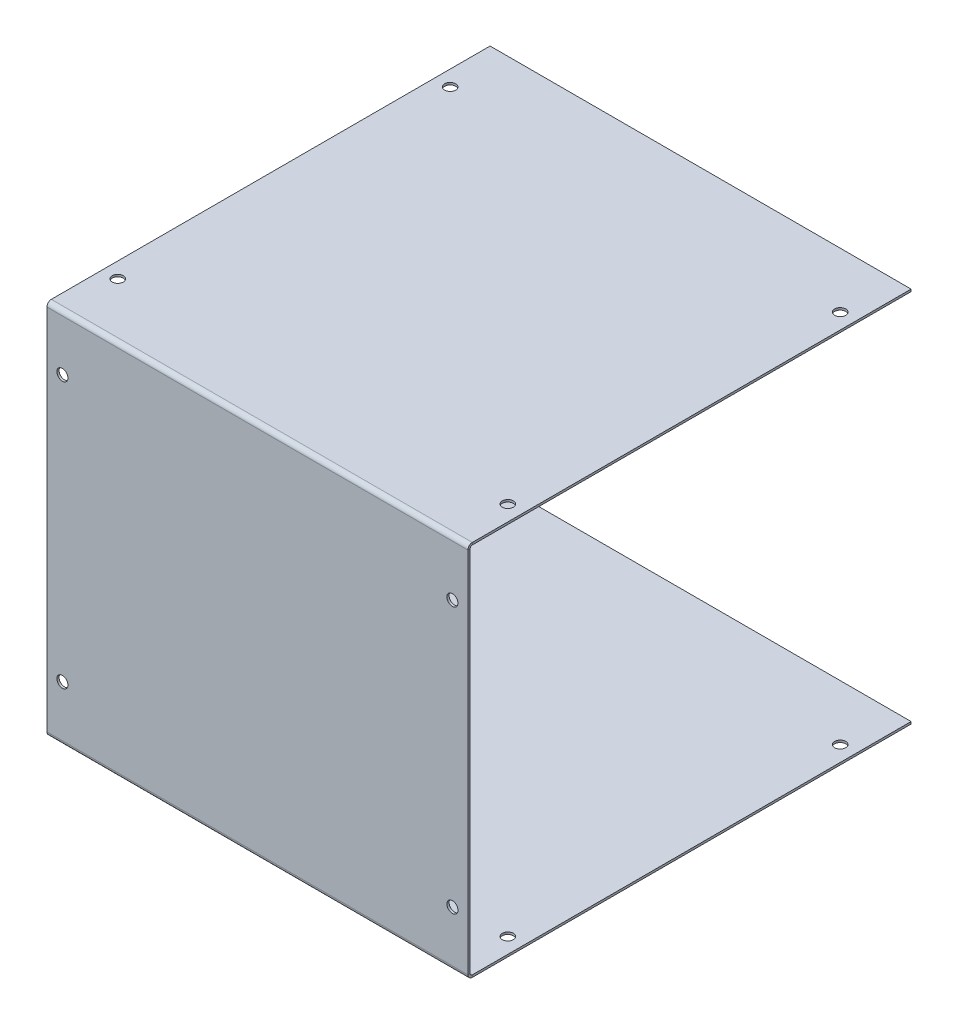
ISO-10303-21;
HEADER;
FILE_DESCRIPTION(('STEP AP214'),'2;1');
FILE_NAME('part.step','',(''),(''),'','','');
FILE_SCHEMA(('AUTOMOTIVE_DESIGN { 1 0 10303 214 1 1 1 1 }'));
ENDSEC;
DATA;
#1=APPLICATION_CONTEXT('core data for automotive mechanical design processes');
#2=APPLICATION_PROTOCOL_DEFINITION('international standard','automotive_design',2000,#1);
#3=PRODUCT_CONTEXT('',#1,'mechanical');
#4=PRODUCT('Part','Part','',(#3));
#5=PRODUCT_RELATED_PRODUCT_CATEGORY('part','',(#4));
#6=PRODUCT_DEFINITION_FORMATION('','',#4);
#7=PRODUCT_DEFINITION_CONTEXT('part definition',#1,'design');
#8=PRODUCT_DEFINITION('design','',#6,#7);
#9=PRODUCT_DEFINITION_SHAPE('','',#8);
#10=(LENGTH_UNIT() NAMED_UNIT(*) SI_UNIT(.MILLI.,.METRE.));
#11=(NAMED_UNIT(*) PLANE_ANGLE_UNIT() SI_UNIT($,.RADIAN.));
#12=(NAMED_UNIT(*) SI_UNIT($,.STERADIAN.) SOLID_ANGLE_UNIT());
#13=UNCERTAINTY_MEASURE_WITH_UNIT(LENGTH_MEASURE(1.E-05),#10,'distance_accuracy_value','');
#14=(GEOMETRIC_REPRESENTATION_CONTEXT(3) GLOBAL_UNCERTAINTY_ASSIGNED_CONTEXT((#13)) GLOBAL_UNIT_ASSIGNED_CONTEXT((#10,
#11,#12)) REPRESENTATION_CONTEXT('',''));
#15=CARTESIAN_POINT('',(0.,0.,0.));
#16=DIRECTION('',(0.,0.,1.));
#17=DIRECTION('',(1.,0.,0.));
#18=AXIS2_PLACEMENT_3D('',#15,#16,#17);
#19=CARTESIAN_POINT('',(0.,0.,-1.));
#20=DIRECTION('',(0.,0.,-1.));
#21=DIRECTION('',(-1.,0.,0.));
#22=AXIS2_PLACEMENT_3D('',#19,#20,#21);
#23=PLANE('',#22);
#24=CARTESIAN_POINT('',(-88.,-60.,-0.999999999999999));
#25=DIRECTION('',(0.,0.,-1.));
#26=DIRECTION('',(-1.,0.,0.));
#27=AXIS2_PLACEMENT_3D('',#24,#25,#26);
#28=CIRCLE('',#27,2.5);
#29=CARTESIAN_POINT('',(-90.5,-60.,-0.999999999999999));
#30=VERTEX_POINT('',#29);
#31=EDGE_CURVE('E305',#30,#30,#28,.T.);
#32=ORIENTED_EDGE('',*,*,#31,.F.);
#33=EDGE_LOOP('',(#32));
#34=FACE_BOUND('',#33,.T.);
#35=CARTESIAN_POINT('',(88.,-60.,-0.999999999999999));
#36=DIRECTION('',(0.,0.,-1.));
#37=DIRECTION('',(-1.,0.,0.));
#38=AXIS2_PLACEMENT_3D('',#35,#36,#37);
#39=CIRCLE('',#38,2.5);
#40=CARTESIAN_POINT('',(85.5,-60.,-0.999999999999999));
#41=VERTEX_POINT('',#40);
#42=EDGE_CURVE('E302',#41,#41,#39,.T.);
#43=ORIENTED_EDGE('',*,*,#42,.F.);
#44=EDGE_LOOP('',(#43));
#45=FACE_BOUND('',#44,.T.);
#46=CARTESIAN_POINT('',(88.,60.,-0.999999999999999));
#47=DIRECTION('',(0.,0.,-1.));
#48=DIRECTION('',(-1.,0.,0.));
#49=AXIS2_PLACEMENT_3D('',#46,#47,#48);
#50=CIRCLE('',#49,2.5);
#51=CARTESIAN_POINT('',(85.5,60.,-0.999999999999999));
#52=VERTEX_POINT('',#51);
#53=EDGE_CURVE('E299',#52,#52,#50,.T.);
#54=ORIENTED_EDGE('',*,*,#53,.F.);
#55=EDGE_LOOP('',(#54));
#56=FACE_BOUND('',#55,.T.);
#57=CARTESIAN_POINT('',(-88.,60.,-0.999999999999999));
#58=DIRECTION('',(0.,0.,-1.));
#59=DIRECTION('',(-1.,0.,0.));
#60=AXIS2_PLACEMENT_3D('',#57,#58,#59);
#61=CIRCLE('',#60,2.5);
#62=CARTESIAN_POINT('',(-90.5,60.,-0.999999999999999));
#63=VERTEX_POINT('',#62);
#64=EDGE_CURVE('E296',#63,#63,#61,.T.);
#65=ORIENTED_EDGE('',*,*,#64,.F.);
#66=EDGE_LOOP('',(#65));
#67=FACE_BOUND('',#66,.T.);
#68=DIRECTION('',(0.,1.,0.));
#69=VECTOR('',#68,1.);
#70=CARTESIAN_POINT('',(95.,-85.,-1.));
#71=LINE('',#70,#69);
#72=CARTESIAN_POINT('',(95.,-83.,-1.));
#73=VERTEX_POINT('',#72);
#74=CARTESIAN_POINT('',(95.,83.,-1.));
#75=VERTEX_POINT('',#74);
#76=EDGE_CURVE('E86',#73,#75,#71,.T.);
#77=ORIENTED_EDGE('',*,*,#76,.F.);
#78=DIRECTION('',(-1.,0.,0.));
#79=VECTOR('',#78,1.);
#80=CARTESIAN_POINT('',(-95.,-83.,-1.));
#81=LINE('',#80,#79);
#82=CARTESIAN_POINT('',(-95.,-83.,-1.));
#83=VERTEX_POINT('',#82);
#84=EDGE_CURVE('E223',#83,#73,#81,.F.);
#85=ORIENTED_EDGE('',*,*,#84,.F.);
#86=DIRECTION('',(0.,-1.,0.));
#87=VECTOR('',#86,1.);
#88=CARTESIAN_POINT('',(-95.,-85.,-1.));
#89=LINE('',#88,#87);
#90=CARTESIAN_POINT('',(-95.,83.,-1.));
#91=VERTEX_POINT('',#90);
#92=EDGE_CURVE('E13',#91,#83,#89,.T.);
#93=ORIENTED_EDGE('',*,*,#92,.F.);
#94=DIRECTION('',(1.,0.,0.));
#95=VECTOR('',#94,1.);
#96=CARTESIAN_POINT('',(95.,83.,-1.));
#97=LINE('',#96,#95);
#98=EDGE_CURVE('E277',#75,#91,#97,.F.);
#99=ORIENTED_EDGE('',*,*,#98,.F.);
#100=EDGE_LOOP('',(#77,#85,#93,#99));
#101=FACE_BOUND('',#100,.T.);
#102=ADVANCED_FACE('F77',(#34,#45,#56,#67,#101),#23,.T.);
#103=CARTESIAN_POINT('',(0.,0.,0.));
#104=DIRECTION('',(0.,0.,-1.));
#105=DIRECTION('',(-1.,0.,0.));
#106=AXIS2_PLACEMENT_3D('',#103,#104,#105);
#107=PLANE('',#106);
#108=CARTESIAN_POINT('',(-88.,-60.,0.));
#109=DIRECTION('',(0.,0.,1.));
#110=DIRECTION('',(1.,0.,0.));
#111=AXIS2_PLACEMENT_3D('',#108,#109,#110);
#112=CIRCLE('',#111,2.5);
#113=CARTESIAN_POINT('',(-85.5,-60.,0.));
#114=VERTEX_POINT('',#113);
#115=EDGE_CURVE('E283',#114,#114,#112,.T.);
#116=ORIENTED_EDGE('',*,*,#115,.F.);
#117=EDGE_LOOP('',(#116));
#118=FACE_BOUND('',#117,.T.);
#119=CARTESIAN_POINT('',(88.,-60.,0.));
#120=DIRECTION('',(0.,0.,1.));
#121=DIRECTION('',(1.,0.,0.));
#122=AXIS2_PLACEMENT_3D('',#119,#120,#121);
#123=CIRCLE('',#122,2.5);
#124=CARTESIAN_POINT('',(90.5,-60.,0.));
#125=VERTEX_POINT('',#124);
#126=EDGE_CURVE('E289',#125,#125,#123,.T.);
#127=ORIENTED_EDGE('',*,*,#126,.F.);
#128=EDGE_LOOP('',(#127));
#129=FACE_BOUND('',#128,.T.);
#130=CARTESIAN_POINT('',(88.,60.,0.));
#131=DIRECTION('',(0.,0.,1.));
#132=DIRECTION('',(1.,0.,0.));
#133=AXIS2_PLACEMENT_3D('',#130,#131,#132);
#134=CIRCLE('',#133,2.5);
#135=CARTESIAN_POINT('',(90.5,60.,0.));
#136=VERTEX_POINT('',#135);
#137=EDGE_CURVE('E285',#136,#136,#134,.T.);
#138=ORIENTED_EDGE('',*,*,#137,.F.);
#139=EDGE_LOOP('',(#138));
#140=FACE_BOUND('',#139,.T.);
#141=CARTESIAN_POINT('',(-88.,60.,0.));
#142=DIRECTION('',(0.,0.,1.));
#143=DIRECTION('',(1.,0.,0.));
#144=AXIS2_PLACEMENT_3D('',#141,#142,#143);
#145=CIRCLE('',#144,2.5);
#146=CARTESIAN_POINT('',(-85.5,60.,0.));
#147=VERTEX_POINT('',#146);
#148=EDGE_CURVE('E288',#147,#147,#145,.T.);
#149=ORIENTED_EDGE('',*,*,#148,.F.);
#150=EDGE_LOOP('',(#149));
#151=FACE_BOUND('',#150,.T.);
#152=DIRECTION('',(-1.,0.,0.));
#153=VECTOR('',#152,1.);
#154=CARTESIAN_POINT('',(-95.,-83.,0.));
#155=LINE('',#154,#153);
#156=CARTESIAN_POINT('',(-95.,-83.,0.));
#157=VERTEX_POINT('',#156);
#158=CARTESIAN_POINT('',(95.,-83.,0.));
#159=VERTEX_POINT('',#158);
#160=EDGE_CURVE('E211',#157,#159,#155,.F.);
#161=ORIENTED_EDGE('',*,*,#160,.T.);
#162=DIRECTION('',(0.,1.,0.));
#163=VECTOR('',#162,1.);
#164=CARTESIAN_POINT('',(95.,-85.,0.));
#165=LINE('',#164,#163);
#166=CARTESIAN_POINT('',(95.,83.,0.));
#167=VERTEX_POINT('',#166);
#168=EDGE_CURVE('E308',#159,#167,#165,.T.);
#169=ORIENTED_EDGE('',*,*,#168,.T.);
#170=DIRECTION('',(1.,0.,0.));
#171=VECTOR('',#170,1.);
#172=CARTESIAN_POINT('',(95.,83.,0.));
#173=LINE('',#172,#171);
#174=CARTESIAN_POINT('',(-95.,83.,0.));
#175=VERTEX_POINT('',#174);
#176=EDGE_CURVE('E265',#167,#175,#173,.F.);
#177=ORIENTED_EDGE('',*,*,#176,.T.);
#178=DIRECTION('',(0.,-1.,0.));
#179=VECTOR('',#178,1.);
#180=CARTESIAN_POINT('',(-95.,-85.,0.));
#181=LINE('',#180,#179);
#182=EDGE_CURVE('E309',#175,#157,#181,.T.);
#183=ORIENTED_EDGE('',*,*,#182,.T.);
#184=EDGE_LOOP('',(#161,#169,#177,#183));
#185=FACE_BOUND('',#184,.T.);
#186=ADVANCED_FACE('F367',(#118,#129,#140,#151,#185),#107,.F.);
#187=CARTESIAN_POINT('',(-95.,-85.,-1.));
#188=DIRECTION('',(-1.,0.,0.));
#189=DIRECTION('',(0.,0.,1.));
#190=AXIS2_PLACEMENT_3D('',#187,#188,#189);
#191=PLANE('',#190);
#192=ORIENTED_EDGE('',*,*,#92,.T.);
#193=DIRECTION('',(0.,0.,1.));
#194=VECTOR('',#193,1.);
#195=CARTESIAN_POINT('',(-95.,-83.,-1.));
#196=LINE('',#195,#194);
#197=EDGE_CURVE('E217',#83,#157,#196,.T.);
#198=ORIENTED_EDGE('',*,*,#197,.T.);
#199=ORIENTED_EDGE('',*,*,#182,.F.);
#200=DIRECTION('',(0.,0.,1.));
#201=VECTOR('',#200,1.);
#202=CARTESIAN_POINT('',(-95.,83.,-1.));
#203=LINE('',#202,#201);
#204=EDGE_CURVE('E93',#91,#175,#203,.T.);
#205=ORIENTED_EDGE('',*,*,#204,.F.);
#206=EDGE_LOOP('',(#192,#198,#199,#205));
#207=FACE_BOUND('',#206,.T.);
#208=ADVANCED_FACE('F361',(#207),#191,.T.);
#209=CARTESIAN_POINT('',(95.,-85.,-1.));
#210=DIRECTION('',(1.,0.,0.));
#211=DIRECTION('',(0.,0.,-1.));
#212=AXIS2_PLACEMENT_3D('',#209,#210,#211);
#213=PLANE('',#212);
#214=DIRECTION('',(0.,0.,1.));
#215=VECTOR('',#214,1.);
#216=CARTESIAN_POINT('',(95.,-83.,-1.));
#217=LINE('',#216,#215);
#218=EDGE_CURVE('E229',#73,#159,#217,.T.);
#219=ORIENTED_EDGE('',*,*,#218,.F.);
#220=ORIENTED_EDGE('',*,*,#76,.T.);
#221=DIRECTION('',(0.,0.,1.));
#222=VECTOR('',#221,1.);
#223=CARTESIAN_POINT('',(95.,83.,-1.));
#224=LINE('',#223,#222);
#225=EDGE_CURVE('E271',#75,#167,#224,.T.);
#226=ORIENTED_EDGE('',*,*,#225,.T.);
#227=ORIENTED_EDGE('',*,*,#168,.F.);
#228=EDGE_LOOP('',(#219,#220,#226,#227));
#229=FACE_BOUND('',#228,.T.);
#230=ADVANCED_FACE('F79',(#229),#213,.T.);
#231=CARTESIAN_POINT('',(-88.,60.,-10.));
#232=DIRECTION('',(0.,0.,1.));
#233=DIRECTION('',(1.,0.,0.));
#234=AXIS2_PLACEMENT_3D('',#231,#232,#233);
#235=CYLINDRICAL_SURFACE('',#234,2.5);
#236=ORIENTED_EDGE('',*,*,#64,.T.);
#237=EDGE_LOOP('',(#236));
#238=FACE_BOUND('',#237,.T.);
#239=ORIENTED_EDGE('',*,*,#148,.T.);
#240=EDGE_LOOP('',(#239));
#241=FACE_BOUND('',#240,.T.);
#242=ADVANCED_FACE('F395',(#238,#241),#235,.F.);
#243=CARTESIAN_POINT('',(88.,60.,-10.));
#244=DIRECTION('',(0.,0.,1.));
#245=DIRECTION('',(1.,0.,0.));
#246=AXIS2_PLACEMENT_3D('',#243,#244,#245);
#247=CYLINDRICAL_SURFACE('',#246,2.5);
#248=ORIENTED_EDGE('',*,*,#53,.T.);
#249=EDGE_LOOP('',(#248));
#250=FACE_BOUND('',#249,.T.);
#251=ORIENTED_EDGE('',*,*,#137,.T.);
#252=EDGE_LOOP('',(#251));
#253=FACE_BOUND('',#252,.T.);
#254=ADVANCED_FACE('F404',(#250,#253),#247,.F.);
#255=CARTESIAN_POINT('',(88.,-60.,-10.));
#256=DIRECTION('',(0.,0.,1.));
#257=DIRECTION('',(1.,0.,0.));
#258=AXIS2_PLACEMENT_3D('',#255,#256,#257);
#259=CYLINDRICAL_SURFACE('',#258,2.5);
#260=ORIENTED_EDGE('',*,*,#42,.T.);
#261=EDGE_LOOP('',(#260));
#262=FACE_BOUND('',#261,.T.);
#263=ORIENTED_EDGE('',*,*,#126,.T.);
#264=EDGE_LOOP('',(#263));
#265=FACE_BOUND('',#264,.T.);
#266=ADVANCED_FACE('F409',(#262,#265),#259,.F.);
#267=CARTESIAN_POINT('',(-88.,-60.,-10.));
#268=DIRECTION('',(0.,0.,1.));
#269=DIRECTION('',(1.,0.,0.));
#270=AXIS2_PLACEMENT_3D('',#267,#268,#269);
#271=CYLINDRICAL_SURFACE('',#270,2.5);
#272=ORIENTED_EDGE('',*,*,#31,.T.);
#273=EDGE_LOOP('',(#272));
#274=FACE_BOUND('',#273,.T.);
#275=ORIENTED_EDGE('',*,*,#115,.T.);
#276=EDGE_LOOP('',(#275));
#277=FACE_BOUND('',#276,.T.);
#278=ADVANCED_FACE('F448',(#274,#277),#271,.F.);
#279=CARTESIAN_POINT('',(-95.,83.,-2.00000000000001));
#280=DIRECTION('',(-1.,0.,0.));
#281=DIRECTION('',(0.,0.,1.));
#282=AXIS2_PLACEMENT_3D('',#279,#280,#281);
#283=PLANE('',#282);
#284=DIRECTION('',(0.,-1.,0.));
#285=VECTOR('',#284,1.);
#286=CARTESIAN_POINT('',(-95.,85.,-2.));
#287=LINE('',#286,#285);
#288=CARTESIAN_POINT('',(-95.,84.,-2.));
#289=VERTEX_POINT('',#288);
#290=CARTESIAN_POINT('',(-95.,85.,-2.));
#291=VERTEX_POINT('',#290);
#292=EDGE_CURVE('E232',#289,#291,#287,.F.);
#293=ORIENTED_EDGE('',*,*,#292,.F.);
#294=CARTESIAN_POINT('',(-95.,83.,-2.00000000000001));
#295=DIRECTION('',(1.,0.,0.));
#296=DIRECTION('',(0.,0.,-1.));
#297=AXIS2_PLACEMENT_3D('',#294,#295,#296);
#298=CIRCLE('',#297,1.);
#299=EDGE_CURVE('E274',#91,#289,#298,.F.);
#300=ORIENTED_EDGE('',*,*,#299,.F.);
#301=ORIENTED_EDGE('',*,*,#204,.T.);
#302=CARTESIAN_POINT('',(-95.,83.,-2.00000000000001));
#303=DIRECTION('',(1.,0.,0.));
#304=DIRECTION('',(0.,0.,-1.));
#305=AXIS2_PLACEMENT_3D('',#302,#303,#304);
#306=CIRCLE('',#305,2.);
#307=EDGE_CURVE('E267',#175,#291,#306,.F.);
#308=ORIENTED_EDGE('',*,*,#307,.T.);
#309=EDGE_LOOP('',(#293,#300,#301,#308));
#310=FACE_BOUND('',#309,.T.);
#311=ADVANCED_FACE('F446',(#310),#283,.T.);
#312=CARTESIAN_POINT('',(95.,83.,-2.00000000000001));
#313=DIRECTION('',(-1.,0.,0.));
#314=DIRECTION('',(0.,0.,1.));
#315=AXIS2_PLACEMENT_3D('',#312,#313,#314);
#316=PLANE('',#315);
#317=CARTESIAN_POINT('',(95.,83.,-2.00000000000001));
#318=DIRECTION('',(1.,0.,0.));
#319=DIRECTION('',(0.,0.,-1.));
#320=AXIS2_PLACEMENT_3D('',#317,#318,#319);
#321=CIRCLE('',#320,1.);
#322=CARTESIAN_POINT('',(95.,84.,-2.));
#323=VERTEX_POINT('',#322);
#324=EDGE_CURVE('E238',#323,#75,#321,.T.);
#325=ORIENTED_EDGE('',*,*,#324,.F.);
#326=DIRECTION('',(0.,-1.,0.));
#327=VECTOR('',#326,1.);
#328=CARTESIAN_POINT('',(95.,84.,-2.));
#329=LINE('',#328,#327);
#330=CARTESIAN_POINT('',(95.,85.,-2.));
#331=VERTEX_POINT('',#330);
#332=EDGE_CURVE('E258',#323,#331,#329,.F.);
#333=ORIENTED_EDGE('',*,*,#332,.T.);
#334=CARTESIAN_POINT('',(95.,83.,-2.00000000000001));
#335=DIRECTION('',(1.,0.,0.));
#336=DIRECTION('',(0.,0.,-1.));
#337=AXIS2_PLACEMENT_3D('',#334,#335,#336);
#338=CIRCLE('',#337,2.);
#339=EDGE_CURVE('E268',#331,#167,#338,.T.);
#340=ORIENTED_EDGE('',*,*,#339,.T.);
#341=ORIENTED_EDGE('',*,*,#225,.F.);
#342=EDGE_LOOP('',(#325,#333,#340,#341));
#343=FACE_BOUND('',#342,.T.);
#344=ADVANCED_FACE('F422',(#343),#316,.F.);
#345=CARTESIAN_POINT('',(95.,83.,-2.00000000000001));
#346=DIRECTION('',(1.,0.,0.));
#347=DIRECTION('',(0.,1.,0.));
#348=AXIS2_PLACEMENT_3D('',#345,#346,#347);
#349=CYLINDRICAL_SURFACE('',#348,2.);
#350=ORIENTED_EDGE('',*,*,#176,.F.);
#351=ORIENTED_EDGE('',*,*,#339,.F.);
#352=DIRECTION('',(1.,0.,0.));
#353=VECTOR('',#352,1.);
#354=CARTESIAN_POINT('',(-95.,85.,-2.));
#355=LINE('',#354,#353);
#356=EDGE_CURVE('E256',#331,#291,#355,.F.);
#357=ORIENTED_EDGE('',*,*,#356,.T.);
#358=ORIENTED_EDGE('',*,*,#307,.F.);
#359=EDGE_LOOP('',(#350,#351,#357,#358));
#360=FACE_BOUND('',#359,.T.);
#361=ADVANCED_FACE('F444',(#360),#349,.T.);
#362=CARTESIAN_POINT('',(95.,83.,-2.00000000000001));
#363=DIRECTION('',(1.,0.,0.));
#364=DIRECTION('',(0.,1.,0.));
#365=AXIS2_PLACEMENT_3D('',#362,#363,#364);
#366=CYLINDRICAL_SURFACE('',#365,1.);
#367=ORIENTED_EDGE('',*,*,#98,.T.);
#368=ORIENTED_EDGE('',*,*,#299,.T.);
#369=DIRECTION('',(1.,0.,0.));
#370=VECTOR('',#369,1.);
#371=CARTESIAN_POINT('',(-95.,84.,-2.));
#372=LINE('',#371,#370);
#373=EDGE_CURVE('E261',#289,#323,#372,.T.);
#374=ORIENTED_EDGE('',*,*,#373,.T.);
#375=ORIENTED_EDGE('',*,*,#324,.T.);
#376=EDGE_LOOP('',(#367,#368,#374,#375));
#377=FACE_BOUND('',#376,.T.);
#378=ADVANCED_FACE('F424',(#377),#366,.F.);
#379=CARTESIAN_POINT('',(95.,85.0000000000007,-200.));
#380=DIRECTION('',(-1.,0.,0.));
#381=DIRECTION('',(0.,0.,1.));
#382=AXIS2_PLACEMENT_3D('',#379,#380,#381);
#383=PLANE('',#382);
#384=ORIENTED_EDGE('',*,*,#332,.F.);
#385=DIRECTION('',(0.,0.,1.));
#386=VECTOR('',#385,1.);
#387=CARTESIAN_POINT('',(95.,84.0000000000007,-200.));
#388=LINE('',#387,#386);
#389=CARTESIAN_POINT('',(94.9999999999999,84.0000000000007,-200.));
#390=VERTEX_POINT('',#389);
#391=EDGE_CURVE('E254',#323,#390,#388,.F.);
#392=ORIENTED_EDGE('',*,*,#391,.T.);
#393=DIRECTION('',(0.,-1.,0.));
#394=VECTOR('',#393,1.);
#395=CARTESIAN_POINT('',(94.9999999999999,85.0000000000007,-200.));
#396=LINE('',#395,#394);
#397=CARTESIAN_POINT('',(94.9999999999999,85.0000000000007,-200.));
#398=VERTEX_POINT('',#397);
#399=EDGE_CURVE('E235',#398,#390,#396,.T.);
#400=ORIENTED_EDGE('',*,*,#399,.F.);
#401=DIRECTION('',(0.,0.,-1.));
#402=VECTOR('',#401,1.);
#403=CARTESIAN_POINT('',(95.,85.,2.80001173087508E-13));
#404=LINE('',#403,#402);
#405=EDGE_CURVE('E247',#331,#398,#404,.T.);
#406=ORIENTED_EDGE('',*,*,#405,.F.);
#407=EDGE_LOOP('',(#384,#392,#400,#406));
#408=FACE_BOUND('',#407,.T.);
#409=ADVANCED_FACE('F438',(#408),#383,.F.);
#410=CARTESIAN_POINT('',(-95.,85.,-0.999999999999997));
#411=DIRECTION('',(1.,0.,0.));
#412=DIRECTION('',(0.,0.,-1.));
#413=AXIS2_PLACEMENT_3D('',#410,#411,#412);
#414=PLANE('',#413);
#415=ORIENTED_EDGE('',*,*,#292,.T.);
#416=DIRECTION('',(0.,0.,1.));
#417=VECTOR('',#416,1.);
#418=CARTESIAN_POINT('',(-95.,85.,2.99876396832368E-13));
#419=LINE('',#418,#417);
#420=CARTESIAN_POINT('',(-95.,85.0000000000007,-200.));
#421=VERTEX_POINT('',#420);
#422=EDGE_CURVE('E242',#421,#291,#419,.T.);
#423=ORIENTED_EDGE('',*,*,#422,.F.);
#424=DIRECTION('',(0.,-1.,0.));
#425=VECTOR('',#424,1.);
#426=CARTESIAN_POINT('',(-95.,85.0000000000007,-200.));
#427=LINE('',#426,#425);
#428=CARTESIAN_POINT('',(-95.,84.0000000000007,-200.));
#429=VERTEX_POINT('',#428);
#430=EDGE_CURVE('E239',#421,#429,#427,.T.);
#431=ORIENTED_EDGE('',*,*,#430,.T.);
#432=DIRECTION('',(0.,0.,-1.));
#433=VECTOR('',#432,1.);
#434=CARTESIAN_POINT('',(-95.,84.,-1.));
#435=LINE('',#434,#433);
#436=EDGE_CURVE('E249',#429,#289,#435,.F.);
#437=ORIENTED_EDGE('',*,*,#436,.T.);
#438=EDGE_LOOP('',(#415,#423,#431,#437));
#439=FACE_BOUND('',#438,.T.);
#440=ADVANCED_FACE('F431',(#439),#414,.F.);
#441=CARTESIAN_POINT('',(0.,85.,2.99876396832368E-13));
#442=DIRECTION('',(0.,-1.,0.));
#443=DIRECTION('',(0.,0.,-1.));
#444=AXIS2_PLACEMENT_3D('',#441,#442,#443);
#445=PLANE('',#444);
#446=CARTESIAN_POINT('',(-88.,85.0000000000001,-25.));
#447=DIRECTION('',(0.,1.,0.));
#448=DIRECTION('',(0.,0.,1.));
#449=AXIS2_PLACEMENT_3D('',#446,#447,#448);
#450=CIRCLE('',#449,2.5);
#451=CARTESIAN_POINT('',(-88.,85.0000000000001,-22.5));
#452=VERTEX_POINT('',#451);
#453=EDGE_CURVE('E766',#452,#452,#450,.T.);
#454=ORIENTED_EDGE('',*,*,#453,.F.);
#455=EDGE_LOOP('',(#454));
#456=FACE_BOUND('',#455,.T.);
#457=CARTESIAN_POINT('',(88.,85.0000000000001,-25.));
#458=DIRECTION('',(0.,1.,0.));
#459=DIRECTION('',(0.,0.,1.));
#460=AXIS2_PLACEMENT_3D('',#457,#458,#459);
#461=CIRCLE('',#460,2.50000000000001);
#462=CARTESIAN_POINT('',(88.,85.0000000000001,-22.5));
#463=VERTEX_POINT('',#462);
#464=EDGE_CURVE('E767',#463,#463,#461,.T.);
#465=ORIENTED_EDGE('',*,*,#464,.F.);
#466=EDGE_LOOP('',(#465));
#467=FACE_BOUND('',#466,.T.);
#468=CARTESIAN_POINT('',(88.,85.0000000000006,-175.));
#469=DIRECTION('',(0.,1.,0.));
#470=DIRECTION('',(0.,0.,1.));
#471=AXIS2_PLACEMENT_3D('',#468,#469,#470);
#472=CIRCLE('',#471,2.50000000000001);
#473=CARTESIAN_POINT('',(88.,85.0000000000006,-172.5));
#474=VERTEX_POINT('',#473);
#475=EDGE_CURVE('E770',#474,#474,#472,.T.);
#476=ORIENTED_EDGE('',*,*,#475,.F.);
#477=EDGE_LOOP('',(#476));
#478=FACE_BOUND('',#477,.T.);
#479=CARTESIAN_POINT('',(-88.,85.0000000000006,-175.));
#480=DIRECTION('',(0.,1.,0.));
#481=DIRECTION('',(0.,0.,1.));
#482=AXIS2_PLACEMENT_3D('',#479,#480,#481);
#483=CIRCLE('',#482,2.5);
#484=CARTESIAN_POINT('',(-88.,85.0000000000006,-172.5));
#485=VERTEX_POINT('',#484);
#486=EDGE_CURVE('E318',#485,#485,#483,.T.);
#487=ORIENTED_EDGE('',*,*,#486,.F.);
#488=EDGE_LOOP('',(#487));
#489=FACE_BOUND('',#488,.T.);
#490=ORIENTED_EDGE('',*,*,#356,.F.);
#491=ORIENTED_EDGE('',*,*,#405,.T.);
#492=DIRECTION('',(-1.,0.,0.));
#493=VECTOR('',#492,1.);
#494=CARTESIAN_POINT('',(0.,85.0000000000007,-200.));
#495=LINE('',#494,#493);
#496=EDGE_CURVE('E245',#398,#421,#495,.T.);
#497=ORIENTED_EDGE('',*,*,#496,.T.);
#498=ORIENTED_EDGE('',*,*,#422,.T.);
#499=EDGE_LOOP('',(#490,#491,#497,#498));
#500=FACE_BOUND('',#499,.T.);
#501=ADVANCED_FACE('F441',(#456,#467,#478,#489,#500),#445,.F.);
#502=CARTESIAN_POINT('',(0.,84.,2.96384915493525E-13));
#503=DIRECTION('',(0.,-1.,0.));
#504=DIRECTION('',(0.,0.,-1.));
#505=AXIS2_PLACEMENT_3D('',#502,#503,#504);
#506=PLANE('',#505);
#507=CARTESIAN_POINT('',(-88.,84.0000000000001,-25.));
#508=DIRECTION('',(0.,-1.,0.));
#509=DIRECTION('',(0.,0.,-1.));
#510=AXIS2_PLACEMENT_3D('',#507,#508,#509);
#511=CIRCLE('',#510,2.5);
#512=CARTESIAN_POINT('',(-88.,84.0000000000001,-27.5));
#513=VERTEX_POINT('',#512);
#514=EDGE_CURVE('E210',#513,#513,#511,.T.);
#515=ORIENTED_EDGE('',*,*,#514,.F.);
#516=EDGE_LOOP('',(#515));
#517=FACE_BOUND('',#516,.T.);
#518=CARTESIAN_POINT('',(88.,84.0000000000001,-25.));
#519=DIRECTION('',(0.,-1.,0.));
#520=DIRECTION('',(0.,0.,-1.));
#521=AXIS2_PLACEMENT_3D('',#518,#519,#520);
#522=CIRCLE('',#521,2.50000000000001);
#523=CARTESIAN_POINT('',(88.,84.0000000000001,-27.5));
#524=VERTEX_POINT('',#523);
#525=EDGE_CURVE('E330',#524,#524,#522,.T.);
#526=ORIENTED_EDGE('',*,*,#525,.F.);
#527=EDGE_LOOP('',(#526));
#528=FACE_BOUND('',#527,.T.);
#529=CARTESIAN_POINT('',(88.,84.0000000000006,-175.));
#530=DIRECTION('',(0.,-1.,0.));
#531=DIRECTION('',(0.,0.,-1.));
#532=AXIS2_PLACEMENT_3D('',#529,#530,#531);
#533=CIRCLE('',#532,2.50000000000001);
#534=CARTESIAN_POINT('',(88.,84.0000000000006,-177.5));
#535=VERTEX_POINT('',#534);
#536=EDGE_CURVE('E326',#535,#535,#533,.T.);
#537=ORIENTED_EDGE('',*,*,#536,.F.);
#538=EDGE_LOOP('',(#537));
#539=FACE_BOUND('',#538,.T.);
#540=CARTESIAN_POINT('',(-88.,84.0000000000006,-175.));
#541=DIRECTION('',(0.,-1.,0.));
#542=DIRECTION('',(0.,0.,-1.));
#543=AXIS2_PLACEMENT_3D('',#540,#541,#542);
#544=CIRCLE('',#543,2.5);
#545=CARTESIAN_POINT('',(-88.,84.0000000000006,-177.5));
#546=VERTEX_POINT('',#545);
#547=EDGE_CURVE('E322',#546,#546,#544,.T.);
#548=ORIENTED_EDGE('',*,*,#547,.F.);
#549=EDGE_LOOP('',(#548));
#550=FACE_BOUND('',#549,.T.);
#551=ORIENTED_EDGE('',*,*,#391,.F.);
#552=ORIENTED_EDGE('',*,*,#373,.F.);
#553=ORIENTED_EDGE('',*,*,#436,.F.);
#554=DIRECTION('',(1.,0.,0.));
#555=VECTOR('',#554,1.);
#556=CARTESIAN_POINT('',(-95.,84.0000000000007,-200.));
#557=LINE('',#556,#555);
#558=EDGE_CURVE('E252',#390,#429,#557,.F.);
#559=ORIENTED_EDGE('',*,*,#558,.F.);
#560=EDGE_LOOP('',(#551,#552,#553,#559));
#561=FACE_BOUND('',#560,.T.);
#562=ADVANCED_FACE('F380',(#517,#528,#539,#550,#561),#506,.T.);
#563=CARTESIAN_POINT('',(-95.,85.0000000000007,-200.));
#564=DIRECTION('',(0.,0.,1.));
#565=DIRECTION('',(0.,-1.,0.));
#566=AXIS2_PLACEMENT_3D('',#563,#564,#565);
#567=PLANE('',#566);
#568=ORIENTED_EDGE('',*,*,#558,.T.);
#569=ORIENTED_EDGE('',*,*,#430,.F.);
#570=ORIENTED_EDGE('',*,*,#496,.F.);
#571=ORIENTED_EDGE('',*,*,#399,.T.);
#572=EDGE_LOOP('',(#568,#569,#570,#571));
#573=FACE_BOUND('',#572,.T.);
#574=ADVANCED_FACE('F373',(#573),#567,.F.);
#575=CARTESIAN_POINT('',(95.,-83.,-2.00000000000001));
#576=DIRECTION('',(1.,0.,0.));
#577=DIRECTION('',(0.,0.,-1.));
#578=AXIS2_PLACEMENT_3D('',#575,#576,#577);
#579=PLANE('',#578);
#580=DIRECTION('',(0.,1.,0.));
#581=VECTOR('',#580,1.);
#582=CARTESIAN_POINT('',(95.,-85.,-2.));
#583=LINE('',#582,#581);
#584=CARTESIAN_POINT('',(95.,-84.,-2.));
#585=VERTEX_POINT('',#584);
#586=CARTESIAN_POINT('',(95.,-85.,-2.));
#587=VERTEX_POINT('',#586);
#588=EDGE_CURVE('E192',#585,#587,#583,.F.);
#589=ORIENTED_EDGE('',*,*,#588,.F.);
#590=CARTESIAN_POINT('',(95.,-83.,-2.00000000000001));
#591=DIRECTION('',(-1.,0.,0.));
#592=DIRECTION('',(0.,0.,1.));
#593=AXIS2_PLACEMENT_3D('',#590,#591,#592);
#594=CIRCLE('',#593,1.);
#595=EDGE_CURVE('E220',#73,#585,#594,.F.);
#596=ORIENTED_EDGE('',*,*,#595,.F.);
#597=ORIENTED_EDGE('',*,*,#218,.T.);
#598=CARTESIAN_POINT('',(95.,-83.,-2.00000000000001));
#599=DIRECTION('',(-1.,0.,0.));
#600=DIRECTION('',(0.,0.,1.));
#601=AXIS2_PLACEMENT_3D('',#598,#599,#600);
#602=CIRCLE('',#601,2.);
#603=EDGE_CURVE('E213',#159,#587,#602,.F.);
#604=ORIENTED_EDGE('',*,*,#603,.T.);
#605=EDGE_LOOP('',(#589,#596,#597,#604));
#606=FACE_BOUND('',#605,.T.);
#607=ADVANCED_FACE('F371',(#606),#579,.T.);
#608=CARTESIAN_POINT('',(-95.,-83.,-2.00000000000001));
#609=DIRECTION('',(1.,0.,0.));
#610=DIRECTION('',(0.,0.,-1.));
#611=AXIS2_PLACEMENT_3D('',#608,#609,#610);
#612=PLANE('',#611);
#613=CARTESIAN_POINT('',(-95.,-83.,-2.00000000000001));
#614=DIRECTION('',(-1.,0.,0.));
#615=DIRECTION('',(0.,0.,1.));
#616=AXIS2_PLACEMENT_3D('',#613,#614,#615);
#617=CIRCLE('',#616,1.);
#618=CARTESIAN_POINT('',(-95.,-84.,-2.));
#619=VERTEX_POINT('',#618);
#620=EDGE_CURVE('E226',#619,#83,#617,.T.);
#621=ORIENTED_EDGE('',*,*,#620,.F.);
#622=DIRECTION('',(0.,1.,0.));
#623=VECTOR('',#622,1.);
#624=CARTESIAN_POINT('',(-95.,-84.,-2.));
#625=LINE('',#624,#623);
#626=CARTESIAN_POINT('',(-95.,-85.,-2.));
#627=VERTEX_POINT('',#626);
#628=EDGE_CURVE('E204',#619,#627,#625,.F.);
#629=ORIENTED_EDGE('',*,*,#628,.T.);
#630=CARTESIAN_POINT('',(-95.,-83.,-2.00000000000001));
#631=DIRECTION('',(-1.,0.,0.));
#632=DIRECTION('',(0.,0.,1.));
#633=AXIS2_PLACEMENT_3D('',#630,#631,#632);
#634=CIRCLE('',#633,2.);
#635=EDGE_CURVE('E214',#627,#157,#634,.T.);
#636=ORIENTED_EDGE('',*,*,#635,.T.);
#637=ORIENTED_EDGE('',*,*,#197,.F.);
#638=EDGE_LOOP('',(#621,#629,#636,#637));
#639=FACE_BOUND('',#638,.T.);
#640=ADVANCED_FACE('F359',(#639),#612,.F.);
#641=CARTESIAN_POINT('',(-95.,-83.,-2.00000000000001));
#642=DIRECTION('',(-1.,0.,0.));
#643=DIRECTION('',(0.,-1.,0.));
#644=AXIS2_PLACEMENT_3D('',#641,#642,#643);
#645=CYLINDRICAL_SURFACE('',#644,2.);
#646=ORIENTED_EDGE('',*,*,#160,.F.);
#647=ORIENTED_EDGE('',*,*,#635,.F.);
#648=DIRECTION('',(-1.,0.,0.));
#649=VECTOR('',#648,1.);
#650=CARTESIAN_POINT('',(95.,-85.,-2.));
#651=LINE('',#650,#649);
#652=EDGE_CURVE('E202',#627,#587,#651,.F.);
#653=ORIENTED_EDGE('',*,*,#652,.T.);
#654=ORIENTED_EDGE('',*,*,#603,.F.);
#655=EDGE_LOOP('',(#646,#647,#653,#654));
#656=FACE_BOUND('',#655,.T.);
#657=ADVANCED_FACE('F364',(#656),#645,.T.);
#658=CARTESIAN_POINT('',(-95.,-83.,-2.00000000000001));
#659=DIRECTION('',(-1.,0.,0.));
#660=DIRECTION('',(0.,-1.,0.));
#661=AXIS2_PLACEMENT_3D('',#658,#659,#660);
#662=CYLINDRICAL_SURFACE('',#661,1.);
#663=ORIENTED_EDGE('',*,*,#84,.T.);
#664=ORIENTED_EDGE('',*,*,#595,.T.);
#665=DIRECTION('',(-1.,0.,0.));
#666=VECTOR('',#665,1.);
#667=CARTESIAN_POINT('',(95.,-84.,-2.));
#668=LINE('',#667,#666);
#669=EDGE_CURVE('E207',#585,#619,#668,.T.);
#670=ORIENTED_EDGE('',*,*,#669,.T.);
#671=ORIENTED_EDGE('',*,*,#620,.T.);
#672=EDGE_LOOP('',(#663,#664,#670,#671));
#673=FACE_BOUND('',#672,.T.);
#674=ADVANCED_FACE('F355',(#673),#662,.F.);
#675=CARTESIAN_POINT('',(-95.,-85.0000000000007,-200.));
#676=DIRECTION('',(1.,0.,0.));
#677=DIRECTION('',(0.,0.,-1.));
#678=AXIS2_PLACEMENT_3D('',#675,#676,#677);
#679=PLANE('',#678);
#680=ORIENTED_EDGE('',*,*,#628,.F.);
#681=DIRECTION('',(0.,0.,1.));
#682=VECTOR('',#681,1.);
#683=CARTESIAN_POINT('',(-95.,-84.0000000000007,-200.));
#684=LINE('',#683,#682);
#685=CARTESIAN_POINT('',(-94.9999999999999,-84.0000000000007,-200.));
#686=VERTEX_POINT('',#685);
#687=EDGE_CURVE('E200',#619,#686,#684,.F.);
#688=ORIENTED_EDGE('',*,*,#687,.T.);
#689=DIRECTION('',(0.,1.,0.));
#690=VECTOR('',#689,1.);
#691=CARTESIAN_POINT('',(-94.9999999999999,-85.0000000000007,-200.));
#692=LINE('',#691,#690);
#693=CARTESIAN_POINT('',(-94.9999999999999,-85.0000000000007,-200.));
#694=VERTEX_POINT('',#693);
#695=EDGE_CURVE('E188',#694,#686,#692,.T.);
#696=ORIENTED_EDGE('',*,*,#695,.F.);
#697=DIRECTION('',(0.,0.,-1.));
#698=VECTOR('',#697,1.);
#699=CARTESIAN_POINT('',(-95.,-85.,2.80001173087508E-13));
#700=LINE('',#699,#698);
#701=EDGE_CURVE('E175',#627,#694,#700,.T.);
#702=ORIENTED_EDGE('',*,*,#701,.F.);
#703=EDGE_LOOP('',(#680,#688,#696,#702));
#704=FACE_BOUND('',#703,.T.);
#705=ADVANCED_FACE('F348',(#704),#679,.F.);
#706=CARTESIAN_POINT('',(95.,-85.,-0.999999999999997));
#707=DIRECTION('',(-1.,0.,0.));
#708=DIRECTION('',(0.,0.,1.));
#709=AXIS2_PLACEMENT_3D('',#706,#707,#708);
#710=PLANE('',#709);
#711=ORIENTED_EDGE('',*,*,#588,.T.);
#712=DIRECTION('',(0.,0.,1.));
#713=VECTOR('',#712,1.);
#714=CARTESIAN_POINT('',(95.,-85.,2.99876396832368E-13));
#715=LINE('',#714,#713);
#716=CARTESIAN_POINT('',(95.,-85.0000000000007,-200.));
#717=VERTEX_POINT('',#716);
#718=EDGE_CURVE('E173',#717,#587,#715,.T.);
#719=ORIENTED_EDGE('',*,*,#718,.F.);
#720=DIRECTION('',(0.,1.,0.));
#721=VECTOR('',#720,1.);
#722=CARTESIAN_POINT('',(95.,-85.0000000000007,-200.));
#723=LINE('',#722,#721);
#724=CARTESIAN_POINT('',(95.,-84.0000000000007,-200.));
#725=VERTEX_POINT('',#724);
#726=EDGE_CURVE('E181',#717,#725,#723,.T.);
#727=ORIENTED_EDGE('',*,*,#726,.T.);
#728=DIRECTION('',(0.,0.,-1.));
#729=VECTOR('',#728,1.);
#730=CARTESIAN_POINT('',(95.,-84.,-1.));
#731=LINE('',#730,#729);
#732=EDGE_CURVE('E197',#725,#585,#731,.F.);
#733=ORIENTED_EDGE('',*,*,#732,.T.);
#734=EDGE_LOOP('',(#711,#719,#727,#733));
#735=FACE_BOUND('',#734,.T.);
#736=ADVANCED_FACE('F191',(#735),#710,.F.);
#737=CARTESIAN_POINT('',(0.,-85.,2.99876396832368E-13));
#738=DIRECTION('',(0.,1.,0.));
#739=DIRECTION('',(0.,0.,1.));
#740=AXIS2_PLACEMENT_3D('',#737,#738,#739);
#741=PLANE('',#740);
#742=CARTESIAN_POINT('',(-88.,-85.0000000000001,-25.0000000000006));
#743=DIRECTION('',(0.,1.,0.));
#744=DIRECTION('',(0.,0.,1.));
#745=AXIS2_PLACEMENT_3D('',#742,#743,#744);
#746=CIRCLE('',#745,2.5);
#747=CARTESIAN_POINT('',(-88.,-85.0000000000001,-22.5000000000006));
#748=VERTEX_POINT('',#747);
#749=EDGE_CURVE('E342',#748,#748,#746,.T.);
#750=ORIENTED_EDGE('',*,*,#749,.T.);
#751=EDGE_LOOP('',(#750));
#752=FACE_BOUND('',#751,.T.);
#753=CARTESIAN_POINT('',(88.,-85.0000000000001,-25.0000000000006));
#754=DIRECTION('',(0.,1.,0.));
#755=DIRECTION('',(0.,0.,1.));
#756=AXIS2_PLACEMENT_3D('',#753,#754,#755);
#757=CIRCLE('',#756,2.50000000000001);
#758=CARTESIAN_POINT('',(88.,-85.0000000000001,-22.5000000000006));
#759=VERTEX_POINT('',#758);
#760=EDGE_CURVE('E325',#759,#759,#757,.T.);
#761=ORIENTED_EDGE('',*,*,#760,.T.);
#762=EDGE_LOOP('',(#761));
#763=FACE_BOUND('',#762,.T.);
#764=CARTESIAN_POINT('',(88.,-85.0000000000006,-175.000000000001));
#765=DIRECTION('',(0.,1.,0.));
#766=DIRECTION('',(0.,0.,1.));
#767=AXIS2_PLACEMENT_3D('',#764,#765,#766);
#768=CIRCLE('',#767,2.50000000000001);
#769=CARTESIAN_POINT('',(88.,-85.0000000000006,-172.500000000001));
#770=VERTEX_POINT('',#769);
#771=EDGE_CURVE('E321',#770,#770,#768,.T.);
#772=ORIENTED_EDGE('',*,*,#771,.T.);
#773=EDGE_LOOP('',(#772));
#774=FACE_BOUND('',#773,.T.);
#775=CARTESIAN_POINT('',(-88.,-85.0000000000006,-175.000000000001));
#776=DIRECTION('',(0.,1.,0.));
#777=DIRECTION('',(0.,0.,1.));
#778=AXIS2_PLACEMENT_3D('',#775,#776,#777);
#779=CIRCLE('',#778,2.5);
#780=CARTESIAN_POINT('',(-88.,-85.0000000000006,-172.500000000001));
#781=VERTEX_POINT('',#780);
#782=EDGE_CURVE('E317',#781,#781,#779,.T.);
#783=ORIENTED_EDGE('',*,*,#782,.T.);
#784=EDGE_LOOP('',(#783));
#785=FACE_BOUND('',#784,.T.);
#786=ORIENTED_EDGE('',*,*,#652,.F.);
#787=ORIENTED_EDGE('',*,*,#701,.T.);
#788=DIRECTION('',(1.,0.,0.));
#789=VECTOR('',#788,1.);
#790=CARTESIAN_POINT('',(0.,-85.0000000000007,-200.));
#791=LINE('',#790,#789);
#792=EDGE_CURVE('E168',#694,#717,#791,.T.);
#793=ORIENTED_EDGE('',*,*,#792,.T.);
#794=ORIENTED_EDGE('',*,*,#718,.T.);
#795=EDGE_LOOP('',(#786,#787,#793,#794));
#796=FACE_BOUND('',#795,.T.);
#797=ADVANCED_FACE('F171',(#752,#763,#774,#785,#796),#741,.F.);
#798=CARTESIAN_POINT('',(0.,-84.,2.96384915493525E-13));
#799=DIRECTION('',(0.,1.,0.));
#800=DIRECTION('',(0.,0.,1.));
#801=AXIS2_PLACEMENT_3D('',#798,#799,#800);
#802=PLANE('',#801);
#803=CARTESIAN_POINT('',(-88.,-84.0000000000001,-25.0000000000006));
#804=DIRECTION('',(0.,1.,0.));
#805=DIRECTION('',(0.,0.,1.));
#806=AXIS2_PLACEMENT_3D('',#803,#804,#805);
#807=CIRCLE('',#806,2.5);
#808=CARTESIAN_POINT('',(-88.,-84.0000000000001,-22.5000000000006));
#809=VERTEX_POINT('',#808);
#810=EDGE_CURVE('E81',#809,#809,#807,.T.);
#811=ORIENTED_EDGE('',*,*,#810,.F.);
#812=EDGE_LOOP('',(#811));
#813=FACE_BOUND('',#812,.T.);
#814=CARTESIAN_POINT('',(88.,-84.0000000000001,-25.0000000000006));
#815=DIRECTION('',(0.,1.,0.));
#816=DIRECTION('',(0.,0.,1.));
#817=AXIS2_PLACEMENT_3D('',#814,#815,#816);
#818=CIRCLE('',#817,2.50000000000001);
#819=CARTESIAN_POINT('',(88.,-84.0000000000001,-22.5000000000006));
#820=VERTEX_POINT('',#819);
#821=EDGE_CURVE('E323',#820,#820,#818,.T.);
#822=ORIENTED_EDGE('',*,*,#821,.F.);
#823=EDGE_LOOP('',(#822));
#824=FACE_BOUND('',#823,.T.);
#825=CARTESIAN_POINT('',(88.,-84.0000000000006,-175.000000000001));
#826=DIRECTION('',(0.,1.,0.));
#827=DIRECTION('',(0.,0.,1.));
#828=AXIS2_PLACEMENT_3D('',#825,#826,#827);
#829=CIRCLE('',#828,2.50000000000001);
#830=CARTESIAN_POINT('',(88.,-84.0000000000006,-172.500000000001));
#831=VERTEX_POINT('',#830);
#832=EDGE_CURVE('E319',#831,#831,#829,.T.);
#833=ORIENTED_EDGE('',*,*,#832,.F.);
#834=EDGE_LOOP('',(#833));
#835=FACE_BOUND('',#834,.T.);
#836=CARTESIAN_POINT('',(-88.,-84.0000000000006,-175.000000000001));
#837=DIRECTION('',(0.,1.,0.));
#838=DIRECTION('',(0.,0.,1.));
#839=AXIS2_PLACEMENT_3D('',#836,#837,#838);
#840=CIRCLE('',#839,2.5);
#841=CARTESIAN_POINT('',(-88.,-84.0000000000006,-172.500000000001));
#842=VERTEX_POINT('',#841);
#843=EDGE_CURVE('E314',#842,#842,#840,.T.);
#844=ORIENTED_EDGE('',*,*,#843,.F.);
#845=EDGE_LOOP('',(#844));
#846=FACE_BOUND('',#845,.T.);
#847=ORIENTED_EDGE('',*,*,#687,.F.);
#848=ORIENTED_EDGE('',*,*,#669,.F.);
#849=ORIENTED_EDGE('',*,*,#732,.F.);
#850=DIRECTION('',(-1.,0.,0.));
#851=VECTOR('',#850,1.);
#852=CARTESIAN_POINT('',(95.,-84.0000000000007,-200.));
#853=LINE('',#852,#851);
#854=EDGE_CURVE('E184',#686,#725,#853,.F.);
#855=ORIENTED_EDGE('',*,*,#854,.F.);
#856=EDGE_LOOP('',(#847,#848,#849,#855));
#857=FACE_BOUND('',#856,.T.);
#858=ADVANCED_FACE('F352',(#813,#824,#835,#846,#857),#802,.T.);
#859=CARTESIAN_POINT('',(95.,-85.0000000000007,-200.));
#860=DIRECTION('',(0.,0.,1.));
#861=DIRECTION('',(0.,-1.,0.));
#862=AXIS2_PLACEMENT_3D('',#859,#860,#861);
#863=PLANE('',#862);
#864=ORIENTED_EDGE('',*,*,#854,.T.);
#865=ORIENTED_EDGE('',*,*,#726,.F.);
#866=ORIENTED_EDGE('',*,*,#792,.F.);
#867=ORIENTED_EDGE('',*,*,#695,.T.);
#868=EDGE_LOOP('',(#864,#865,#866,#867));
#869=FACE_BOUND('',#868,.T.);
#870=ADVANCED_FACE('F182',(#869),#863,.F.);
#871=CARTESIAN_POINT('',(-88.,-94.9999999999994,-175.000000000001));
#872=DIRECTION('',(0.,1.,0.));
#873=DIRECTION('',(0.,0.,1.));
#874=AXIS2_PLACEMENT_3D('',#871,#872,#873);
#875=CYLINDRICAL_SURFACE('',#874,2.5);
#876=ORIENTED_EDGE('',*,*,#843,.T.);
#877=EDGE_LOOP('',(#876));
#878=FACE_BOUND('',#877,.T.);
#879=ORIENTED_EDGE('',*,*,#782,.F.);
#880=EDGE_LOOP('',(#879));
#881=FACE_BOUND('',#880,.T.);
#882=ADVANCED_FACE('F614',(#878,#881),#875,.F.);
#883=CARTESIAN_POINT('',(88.,-94.9999999999994,-175.000000000001));
#884=DIRECTION('',(0.,1.,0.));
#885=DIRECTION('',(0.,0.,1.));
#886=AXIS2_PLACEMENT_3D('',#883,#884,#885);
#887=CYLINDRICAL_SURFACE('',#886,2.50000000000001);
#888=ORIENTED_EDGE('',*,*,#832,.T.);
#889=EDGE_LOOP('',(#888));
#890=FACE_BOUND('',#889,.T.);
#891=ORIENTED_EDGE('',*,*,#771,.F.);
#892=EDGE_LOOP('',(#891));
#893=FACE_BOUND('',#892,.T.);
#894=ADVANCED_FACE('F658',(#890,#893),#887,.F.);
#895=CARTESIAN_POINT('',(88.,-94.9999999999999,-25.0000000000007));
#896=DIRECTION('',(0.,1.,0.));
#897=DIRECTION('',(0.,0.,1.));
#898=AXIS2_PLACEMENT_3D('',#895,#896,#897);
#899=CYLINDRICAL_SURFACE('',#898,2.50000000000001);
#900=ORIENTED_EDGE('',*,*,#821,.T.);
#901=EDGE_LOOP('',(#900));
#902=FACE_BOUND('',#901,.T.);
#903=ORIENTED_EDGE('',*,*,#760,.F.);
#904=EDGE_LOOP('',(#903));
#905=FACE_BOUND('',#904,.T.);
#906=ADVANCED_FACE('F670',(#902,#905),#899,.F.);
#907=CARTESIAN_POINT('',(-88.,-94.9999999999999,-25.0000000000006));
#908=DIRECTION('',(0.,1.,0.));
#909=DIRECTION('',(0.,0.,1.));
#910=AXIS2_PLACEMENT_3D('',#907,#908,#909);
#911=CYLINDRICAL_SURFACE('',#910,2.5);
#912=ORIENTED_EDGE('',*,*,#810,.T.);
#913=EDGE_LOOP('',(#912));
#914=FACE_BOUND('',#913,.T.);
#915=ORIENTED_EDGE('',*,*,#749,.F.);
#916=EDGE_LOOP('',(#915));
#917=FACE_BOUND('',#916,.T.);
#918=ADVANCED_FACE('F682',(#914,#917),#911,.F.);
#919=ORIENTED_EDGE('',*,*,#547,.T.);
#920=EDGE_LOOP('',(#919));
#921=FACE_BOUND('',#920,.T.);
#922=ORIENTED_EDGE('',*,*,#486,.T.);
#923=EDGE_LOOP('',(#922));
#924=FACE_BOUND('',#923,.T.);
#925=ADVANCED_FACE('F661',(#921,#924),#875,.F.);
#926=ORIENTED_EDGE('',*,*,#536,.T.);
#927=EDGE_LOOP('',(#926));
#928=FACE_BOUND('',#927,.T.);
#929=ORIENTED_EDGE('',*,*,#475,.T.);
#930=EDGE_LOOP('',(#929));
#931=FACE_BOUND('',#930,.T.);
#932=ADVANCED_FACE('F673',(#928,#931),#887,.F.);
#933=ORIENTED_EDGE('',*,*,#525,.T.);
#934=EDGE_LOOP('',(#933));
#935=FACE_BOUND('',#934,.T.);
#936=ORIENTED_EDGE('',*,*,#464,.T.);
#937=EDGE_LOOP('',(#936));
#938=FACE_BOUND('',#937,.T.);
#939=ADVANCED_FACE('F684',(#935,#938),#899,.F.);
#940=ORIENTED_EDGE('',*,*,#514,.T.);
#941=EDGE_LOOP('',(#940));
#942=FACE_BOUND('',#941,.T.);
#943=ORIENTED_EDGE('',*,*,#453,.T.);
#944=EDGE_LOOP('',(#943));
#945=FACE_BOUND('',#944,.T.);
#946=ADVANCED_FACE('F695',(#942,#945),#911,.F.);
#947=CLOSED_SHELL('',(#102,#186,#208,#230,#242,#254,#266,#278,#311,#344,#361,#378,#409,#440,
#501,#562,#574,#607,#640,#657,#674,#705,#736,#797,#858,#870,#882,#894,#906,#918,#925,#932,#939,#946));
#948=MANIFOLD_SOLID_BREP('B2',#947);
#949=ADVANCED_BREP_SHAPE_REPRESENTATION('',(#18,#948),#14);
#950=SHAPE_DEFINITION_REPRESENTATION(#9,#949);
ENDSEC;
END-ISO-10303-21;
